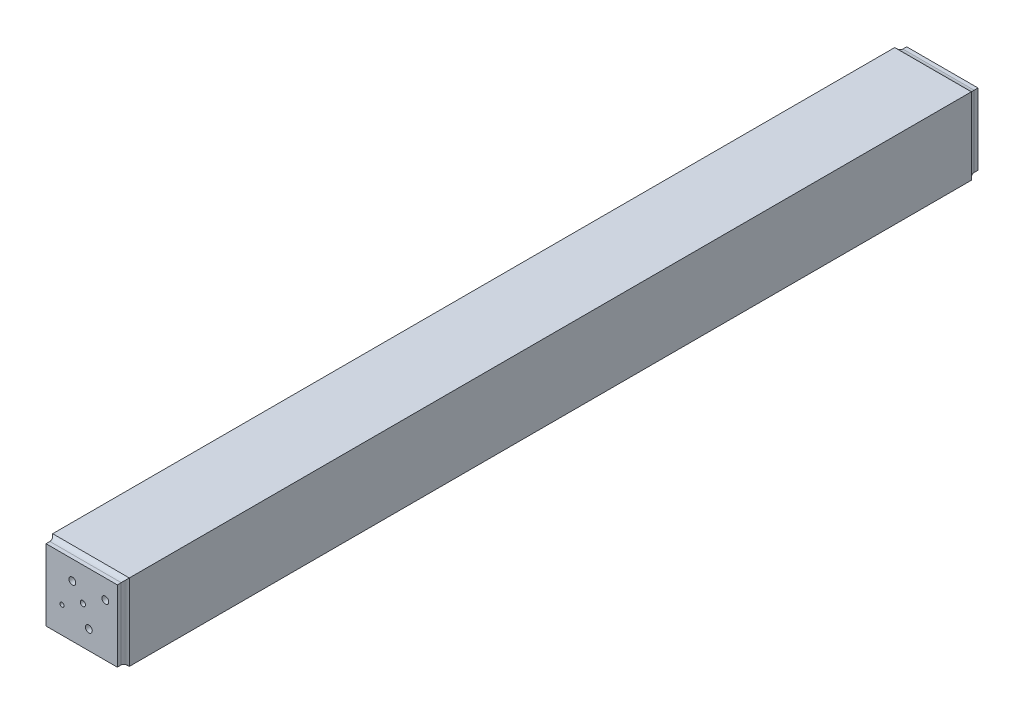
ISO-10303-21;
HEADER;
FILE_DESCRIPTION(('STEP AP214'),'2;1');
FILE_NAME('part.step','',(''),(''),'','','');
FILE_SCHEMA(('AUTOMOTIVE_DESIGN { 1 0 10303 214 1 1 1 1 }'));
ENDSEC;
DATA;
#1=APPLICATION_CONTEXT('core data for automotive mechanical design processes');
#2=APPLICATION_PROTOCOL_DEFINITION('international standard','automotive_design',2000,#1);
#3=PRODUCT_CONTEXT('',#1,'mechanical');
#4=PRODUCT('Part','Part','',(#3));
#5=PRODUCT_RELATED_PRODUCT_CATEGORY('part','',(#4));
#6=PRODUCT_DEFINITION_FORMATION('','',#4);
#7=PRODUCT_DEFINITION_CONTEXT('part definition',#1,'design');
#8=PRODUCT_DEFINITION('design','',#6,#7);
#9=PRODUCT_DEFINITION_SHAPE('','',#8);
#10=(LENGTH_UNIT() NAMED_UNIT(*) SI_UNIT(.MILLI.,.METRE.));
#11=(NAMED_UNIT(*) PLANE_ANGLE_UNIT() SI_UNIT($,.RADIAN.));
#12=(NAMED_UNIT(*) SI_UNIT($,.STERADIAN.) SOLID_ANGLE_UNIT());
#13=UNCERTAINTY_MEASURE_WITH_UNIT(LENGTH_MEASURE(1.E-05),#10,'distance_accuracy_value','');
#14=(GEOMETRIC_REPRESENTATION_CONTEXT(3) GLOBAL_UNCERTAINTY_ASSIGNED_CONTEXT((#13)) GLOBAL_UNIT_ASSIGNED_CONTEXT((#10,
#11,#12)) REPRESENTATION_CONTEXT('',''));
#15=CARTESIAN_POINT('',(0.,0.,0.));
#16=DIRECTION('',(0.,0.,1.));
#17=DIRECTION('',(1.,0.,0.));
#18=AXIS2_PLACEMENT_3D('',#15,#16,#17);
#19=CARTESIAN_POINT('',(42.98,-42.98,0.));
#20=DIRECTION('',(0.,0.,-1.));
#21=DIRECTION('',(-1.,0.,0.));
#22=AXIS2_PLACEMENT_3D('',#19,#20,#21);
#23=PLANE('',#22);
#24=CARTESIAN_POINT('',(12.93,-12.9,0.));
#25=DIRECTION('',(0.,0.,1.));
#26=DIRECTION('',(1.,0.,0.));
#27=AXIS2_PLACEMENT_3D('',#24,#25,#26);
#28=CIRCLE('',#27,2.);
#29=CARTESIAN_POINT('',(14.93,-12.9,0.));
#30=VERTEX_POINT('',#29);
#31=EDGE_CURVE('E249',#30,#30,#28,.T.);
#32=ORIENTED_EDGE('',*,*,#31,.F.);
#33=EDGE_LOOP('',(#32));
#34=FACE_BOUND('',#33,.T.);
#35=CARTESIAN_POINT('',(31.93,-12.9,0.));
#36=DIRECTION('',(0.,0.,1.));
#37=DIRECTION('',(1.,0.,0.));
#38=AXIS2_PLACEMENT_3D('',#35,#36,#37);
#39=CIRCLE('',#38,2.);
#40=CARTESIAN_POINT('',(33.93,-12.9,0.));
#41=VERTEX_POINT('',#40);
#42=EDGE_CURVE('E240',#41,#41,#39,.T.);
#43=ORIENTED_EDGE('',*,*,#42,.F.);
#44=EDGE_LOOP('',(#43));
#45=FACE_BOUND('',#44,.T.);
#46=DIRECTION('',(0.,1.,0.));
#47=VECTOR('',#46,1.);
#48=CARTESIAN_POINT('',(3.17499999999999,-3.175,0.));
#49=LINE('',#48,#47);
#50=CARTESIAN_POINT('',(3.17500000000001,-41.355,0.));
#51=VERTEX_POINT('',#50);
#52=CARTESIAN_POINT('',(3.175,-3.175,0.));
#53=VERTEX_POINT('',#52);
#54=EDGE_CURVE('E171',#51,#53,#49,.T.);
#55=ORIENTED_EDGE('',*,*,#54,.F.);
#56=DIRECTION('',(-1.,0.,0.));
#57=VECTOR('',#56,1.);
#58=CARTESIAN_POINT('',(3.17500000000001,-41.355,0.));
#59=LINE('',#58,#57);
#60=CARTESIAN_POINT('',(41.355,-41.355,0.));
#61=VERTEX_POINT('',#60);
#62=EDGE_CURVE('E184',#61,#51,#59,.T.);
#63=ORIENTED_EDGE('',*,*,#62,.F.);
#64=DIRECTION('',(0.,-1.,0.));
#65=VECTOR('',#64,1.);
#66=CARTESIAN_POINT('',(41.355,-3.17500000000001,0.));
#67=LINE('',#66,#65);
#68=CARTESIAN_POINT('',(41.355,-3.17500000000001,0.));
#69=VERTEX_POINT('',#68);
#70=EDGE_CURVE('E196',#69,#61,#67,.T.);
#71=ORIENTED_EDGE('',*,*,#70,.F.);
#72=DIRECTION('',(1.,0.,0.));
#73=VECTOR('',#72,1.);
#74=CARTESIAN_POINT('',(3.17499999999999,-3.175,0.));
#75=LINE('',#74,#73);
#76=EDGE_CURVE('E174',#53,#69,#75,.T.);
#77=ORIENTED_EDGE('',*,*,#76,.F.);
#78=EDGE_LOOP('',(#55,#63,#71,#77));
#79=FACE_BOUND('',#78,.T.);
#80=ADVANCED_FACE('F31',(#34,#45,#79),#23,.F.);
#81=CARTESIAN_POINT('',(42.98,-1.55,-5.42));
#82=DIRECTION('',(1.,0.,0.));
#83=DIRECTION('',(0.,1.,0.));
#84=AXIS2_PLACEMENT_3D('',#81,#82,#83);
#85=PLANE('',#84);
#86=DIRECTION('',(0.,0.,1.));
#87=VECTOR('',#86,1.);
#88=CARTESIAN_POINT('',(42.98,-1.55,-5.42));
#89=LINE('',#88,#87);
#90=CARTESIAN_POINT('',(42.98,-1.55,-5.42));
#91=VERTEX_POINT('',#90);
#92=CARTESIAN_POINT('',(42.98,-1.55,-3.16188235075248));
#93=VERTEX_POINT('',#92);
#94=EDGE_CURVE('E269',#91,#93,#89,.T.);
#95=ORIENTED_EDGE('',*,*,#94,.T.);
#96=DIRECTION('',(0.,-1.,0.));
#97=VECTOR('',#96,1.);
#98=CARTESIAN_POINT('',(42.98,-42.98,-3.16188235075249));
#99=LINE('',#98,#97);
#100=CARTESIAN_POINT('',(42.98,-42.98,-3.16188235075249));
#101=VERTEX_POINT('',#100);
#102=EDGE_CURVE('E40',#93,#101,#99,.T.);
#103=ORIENTED_EDGE('',*,*,#102,.T.);
#104=DIRECTION('',(0.,0.,1.));
#105=VECTOR('',#104,1.);
#106=CARTESIAN_POINT('',(42.98,-42.98,-5.42));
#107=LINE('',#106,#105);
#108=CARTESIAN_POINT('',(42.98,-42.98,-5.42));
#109=VERTEX_POINT('',#108);
#110=EDGE_CURVE('E270',#109,#101,#107,.T.);
#111=ORIENTED_EDGE('',*,*,#110,.F.);
#112=DIRECTION('',(0.,1.,0.));
#113=VECTOR('',#112,1.);
#114=CARTESIAN_POINT('',(42.98,-1.55,-5.42));
#115=LINE('',#114,#113);
#116=EDGE_CURVE('E255',#109,#91,#115,.T.);
#117=ORIENTED_EDGE('',*,*,#116,.T.);
#118=EDGE_LOOP('',(#95,#103,#111,#117));
#119=FACE_BOUND('',#118,.T.);
#120=ADVANCED_FACE('F378',(#119),#85,.T.);
#121=CARTESIAN_POINT('',(42.98,-42.98,-5.42));
#122=DIRECTION('',(0.,-1.,0.));
#123=DIRECTION('',(0.,0.,-1.));
#124=AXIS2_PLACEMENT_3D('',#121,#122,#123);
#125=PLANE('',#124);
#126=ORIENTED_EDGE('',*,*,#110,.T.);
#127=DIRECTION('',(-1.,0.,0.));
#128=VECTOR('',#127,1.);
#129=CARTESIAN_POINT('',(1.55,-42.98,-3.16188235075248));
#130=LINE('',#129,#128);
#131=CARTESIAN_POINT('',(1.55,-42.98,-3.16188235075248));
#132=VERTEX_POINT('',#131);
#133=EDGE_CURVE('E288',#101,#132,#130,.T.);
#134=ORIENTED_EDGE('',*,*,#133,.T.);
#135=DIRECTION('',(0.,0.,1.));
#136=VECTOR('',#135,1.);
#137=CARTESIAN_POINT('',(1.55,-42.98,-5.42));
#138=LINE('',#137,#136);
#139=CARTESIAN_POINT('',(1.55,-42.98,-5.42));
#140=VERTEX_POINT('',#139);
#141=EDGE_CURVE('E273',#140,#132,#138,.T.);
#142=ORIENTED_EDGE('',*,*,#141,.F.);
#143=DIRECTION('',(1.,0.,0.));
#144=VECTOR('',#143,1.);
#145=CARTESIAN_POINT('',(42.98,-42.98,-5.42));
#146=LINE('',#145,#144);
#147=EDGE_CURVE('E266',#140,#109,#146,.T.);
#148=ORIENTED_EDGE('',*,*,#147,.T.);
#149=EDGE_LOOP('',(#126,#134,#142,#148));
#150=FACE_BOUND('',#149,.T.);
#151=ADVANCED_FACE('F321',(#150),#125,.T.);
#152=CARTESIAN_POINT('',(1.55,-1.55,-5.42));
#153=DIRECTION('',(-1.,0.,0.));
#154=DIRECTION('',(0.,-1.,0.));
#155=AXIS2_PLACEMENT_3D('',#152,#153,#154);
#156=PLANE('',#155);
#157=ORIENTED_EDGE('',*,*,#141,.T.);
#158=DIRECTION('',(0.,1.,0.));
#159=VECTOR('',#158,1.);
#160=CARTESIAN_POINT('',(1.55,-1.55,-3.16188235075248));
#161=LINE('',#160,#159);
#162=CARTESIAN_POINT('',(1.55,-1.55,-3.16188235075248));
#163=VERTEX_POINT('',#162);
#164=EDGE_CURVE('E285',#132,#163,#161,.T.);
#165=ORIENTED_EDGE('',*,*,#164,.T.);
#166=DIRECTION('',(0.,0.,1.));
#167=VECTOR('',#166,1.);
#168=CARTESIAN_POINT('',(1.55,-1.55,-5.42));
#169=LINE('',#168,#167);
#170=CARTESIAN_POINT('',(1.55,-1.55,-5.42));
#171=VERTEX_POINT('',#170);
#172=EDGE_CURVE('E276',#171,#163,#169,.T.);
#173=ORIENTED_EDGE('',*,*,#172,.F.);
#174=DIRECTION('',(0.,-1.,0.));
#175=VECTOR('',#174,1.);
#176=CARTESIAN_POINT('',(1.55,-1.55,-5.42));
#177=LINE('',#176,#175);
#178=EDGE_CURVE('E263',#171,#140,#177,.T.);
#179=ORIENTED_EDGE('',*,*,#178,.T.);
#180=EDGE_LOOP('',(#157,#165,#173,#179));
#181=FACE_BOUND('',#180,.T.);
#182=ADVANCED_FACE('F324',(#181),#156,.T.);
#183=CARTESIAN_POINT('',(42.98,-1.55,-5.42));
#184=DIRECTION('',(0.,1.,0.));
#185=DIRECTION('',(0.,0.,1.));
#186=AXIS2_PLACEMENT_3D('',#183,#184,#185);
#187=PLANE('',#186);
#188=ORIENTED_EDGE('',*,*,#172,.T.);
#189=DIRECTION('',(1.,0.,0.));
#190=VECTOR('',#189,1.);
#191=CARTESIAN_POINT('',(42.98,-1.55,-3.16188235075248));
#192=LINE('',#191,#190);
#193=EDGE_CURVE('E11',#163,#93,#192,.T.);
#194=ORIENTED_EDGE('',*,*,#193,.T.);
#195=ORIENTED_EDGE('',*,*,#94,.F.);
#196=DIRECTION('',(-1.,0.,0.));
#197=VECTOR('',#196,1.);
#198=CARTESIAN_POINT('',(42.98,-1.55,-5.42));
#199=LINE('',#198,#197);
#200=EDGE_CURVE('E260',#91,#171,#199,.T.);
#201=ORIENTED_EDGE('',*,*,#200,.T.);
#202=EDGE_LOOP('',(#188,#194,#195,#201));
#203=FACE_BOUND('',#202,.T.);
#204=ADVANCED_FACE('F395',(#203),#187,.T.);
#205=CARTESIAN_POINT('',(42.98,-42.98,-5.42));
#206=DIRECTION('',(0.,0.,-1.));
#207=DIRECTION('',(-1.,0.,0.));
#208=AXIS2_PLACEMENT_3D('',#205,#206,#207);
#209=PLANE('',#208);
#210=CARTESIAN_POINT('',(31.93,-12.9,-5.42));
#211=DIRECTION('',(0.,0.,1.));
#212=DIRECTION('',(1.,0.,0.));
#213=AXIS2_PLACEMENT_3D('',#210,#211,#212);
#214=CIRCLE('',#213,2.);
#215=CARTESIAN_POINT('',(33.93,-12.9,-5.42));
#216=VERTEX_POINT('',#215);
#217=EDGE_CURVE('E246',#216,#216,#214,.T.);
#218=ORIENTED_EDGE('',*,*,#217,.T.);
#219=EDGE_LOOP('',(#218));
#220=FACE_BOUND('',#219,.T.);
#221=CARTESIAN_POINT('',(12.93,-12.9,-5.42));
#222=DIRECTION('',(0.,0.,1.));
#223=DIRECTION('',(1.,0.,0.));
#224=AXIS2_PLACEMENT_3D('',#221,#222,#223);
#225=CIRCLE('',#224,2.);
#226=CARTESIAN_POINT('',(14.93,-12.9,-5.42));
#227=VERTEX_POINT('',#226);
#228=EDGE_CURVE('E252',#227,#227,#225,.T.);
#229=ORIENTED_EDGE('',*,*,#228,.T.);
#230=EDGE_LOOP('',(#229));
#231=FACE_BOUND('',#230,.T.);
#232=ORIENTED_EDGE('',*,*,#116,.F.);
#233=ORIENTED_EDGE('',*,*,#147,.F.);
#234=ORIENTED_EDGE('',*,*,#178,.F.);
#235=ORIENTED_EDGE('',*,*,#200,.F.);
#236=EDGE_LOOP('',(#232,#233,#234,#235));
#237=FACE_BOUND('',#236,.T.);
#238=ADVANCED_FACE('F389',(#220,#231,#237),#209,.T.);
#239=CARTESIAN_POINT('',(12.93,-12.9,-5.42));
#240=DIRECTION('',(0.,0.,1.));
#241=DIRECTION('',(1.,0.,0.));
#242=AXIS2_PLACEMENT_3D('',#239,#240,#241);
#243=CYLINDRICAL_SURFACE('',#242,2.);
#244=ORIENTED_EDGE('',*,*,#228,.F.);
#245=EDGE_LOOP('',(#244));
#246=FACE_BOUND('',#245,.T.);
#247=ORIENTED_EDGE('',*,*,#31,.T.);
#248=EDGE_LOOP('',(#247));
#249=FACE_BOUND('',#248,.T.);
#250=ADVANCED_FACE('F657',(#246,#249),#243,.F.);
#251=CARTESIAN_POINT('',(31.93,-12.9,-5.42));
#252=DIRECTION('',(0.,0.,1.));
#253=DIRECTION('',(1.,0.,0.));
#254=AXIS2_PLACEMENT_3D('',#251,#252,#253);
#255=CYLINDRICAL_SURFACE('',#254,2.);
#256=ORIENTED_EDGE('',*,*,#217,.F.);
#257=EDGE_LOOP('',(#256));
#258=FACE_BOUND('',#257,.T.);
#259=ORIENTED_EDGE('',*,*,#42,.T.);
#260=EDGE_LOOP('',(#259));
#261=FACE_BOUND('',#260,.T.);
#262=ADVANCED_FACE('F520',(#258,#261),#255,.F.);
#263=CARTESIAN_POINT('',(0.,0.,489.16));
#264=DIRECTION('',(-1.,0.,0.));
#265=DIRECTION('',(0.,-1.,0.));
#266=AXIS2_PLACEMENT_3D('',#263,#264,#265);
#267=PLANE('',#266);
#268=DIRECTION('',(0.,1.,0.));
#269=VECTOR('',#268,1.);
#270=CARTESIAN_POINT('',(0.,0.,0.));
#271=LINE('',#270,#269);
#272=CARTESIAN_POINT('',(0.,-44.53,0.));
#273=VERTEX_POINT('',#272);
#274=CARTESIAN_POINT('',(0.,0.,0.));
#275=VERTEX_POINT('',#274);
#276=EDGE_CURVE('E204',#273,#275,#271,.T.);
#277=ORIENTED_EDGE('',*,*,#276,.F.);
#278=DIRECTION('',(0.,0.,-1.));
#279=VECTOR('',#278,1.);
#280=CARTESIAN_POINT('',(0.,-44.53,489.16));
#281=LINE('',#280,#279);
#282=CARTESIAN_POINT('',(0.,-44.53,489.16));
#283=VERTEX_POINT('',#282);
#284=EDGE_CURVE('E237',#283,#273,#281,.T.);
#285=ORIENTED_EDGE('',*,*,#284,.F.);
#286=DIRECTION('',(0.,1.,0.));
#287=VECTOR('',#286,1.);
#288=CARTESIAN_POINT('',(0.,0.,489.16));
#289=LINE('',#288,#287);
#290=CARTESIAN_POINT('',(0.,0.,489.16));
#291=VERTEX_POINT('',#290);
#292=EDGE_CURVE('E213',#283,#291,#289,.T.);
#293=ORIENTED_EDGE('',*,*,#292,.T.);
#294=DIRECTION('',(0.,0.,-1.));
#295=VECTOR('',#294,1.);
#296=CARTESIAN_POINT('',(0.,0.,489.16));
#297=LINE('',#296,#295);
#298=EDGE_CURVE('E226',#291,#275,#297,.T.);
#299=ORIENTED_EDGE('',*,*,#298,.T.);
#300=EDGE_LOOP('',(#277,#285,#293,#299));
#301=FACE_BOUND('',#300,.T.);
#302=ADVANCED_FACE('F332',(#301),#267,.T.);
#303=CARTESIAN_POINT('',(0.,-44.53,489.16));
#304=DIRECTION('',(0.,-1.,0.));
#305=DIRECTION('',(0.,0.,-1.));
#306=AXIS2_PLACEMENT_3D('',#303,#304,#305);
#307=PLANE('',#306);
#308=DIRECTION('',(-1.,0.,0.));
#309=VECTOR('',#308,1.);
#310=CARTESIAN_POINT('',(0.,-44.53,0.));
#311=LINE('',#310,#309);
#312=CARTESIAN_POINT('',(44.53,-44.53,0.));
#313=VERTEX_POINT('',#312);
#314=EDGE_CURVE('E217',#313,#273,#311,.T.);
#315=ORIENTED_EDGE('',*,*,#314,.F.);
#316=DIRECTION('',(0.,0.,-1.));
#317=VECTOR('',#316,1.);
#318=CARTESIAN_POINT('',(44.53,-44.53,489.16));
#319=LINE('',#318,#317);
#320=CARTESIAN_POINT('',(44.53,-44.53,489.16));
#321=VERTEX_POINT('',#320);
#322=EDGE_CURVE('E241',#321,#313,#319,.T.);
#323=ORIENTED_EDGE('',*,*,#322,.F.);
#324=DIRECTION('',(-1.,0.,0.));
#325=VECTOR('',#324,1.);
#326=CARTESIAN_POINT('',(0.,-44.53,489.16));
#327=LINE('',#326,#325);
#328=EDGE_CURVE('E223',#321,#283,#327,.T.);
#329=ORIENTED_EDGE('',*,*,#328,.T.);
#330=ORIENTED_EDGE('',*,*,#284,.T.);
#331=EDGE_LOOP('',(#315,#323,#329,#330));
#332=FACE_BOUND('',#331,.T.);
#333=ADVANCED_FACE('F344',(#332),#307,.T.);
#334=CARTESIAN_POINT('',(44.53,0.,489.16));
#335=DIRECTION('',(1.,0.,0.));
#336=DIRECTION('',(0.,1.,0.));
#337=AXIS2_PLACEMENT_3D('',#334,#335,#336);
#338=PLANE('',#337);
#339=DIRECTION('',(0.,-1.,0.));
#340=VECTOR('',#339,1.);
#341=CARTESIAN_POINT('',(44.53,0.,0.));
#342=LINE('',#341,#340);
#343=CARTESIAN_POINT('',(44.53,0.,0.));
#344=VERTEX_POINT('',#343);
#345=EDGE_CURVE('E232',#344,#313,#342,.T.);
#346=ORIENTED_EDGE('',*,*,#345,.F.);
#347=DIRECTION('',(0.,0.,-1.));
#348=VECTOR('',#347,1.);
#349=CARTESIAN_POINT('',(44.53,0.,489.16));
#350=LINE('',#349,#348);
#351=CARTESIAN_POINT('',(44.53,0.,489.16));
#352=VERTEX_POINT('',#351);
#353=EDGE_CURVE('E243',#352,#344,#350,.T.);
#354=ORIENTED_EDGE('',*,*,#353,.F.);
#355=DIRECTION('',(0.,-1.,0.));
#356=VECTOR('',#355,1.);
#357=CARTESIAN_POINT('',(44.53,0.,489.16));
#358=LINE('',#357,#356);
#359=EDGE_CURVE('E220',#352,#321,#358,.T.);
#360=ORIENTED_EDGE('',*,*,#359,.T.);
#361=ORIENTED_EDGE('',*,*,#322,.T.);
#362=EDGE_LOOP('',(#346,#354,#360,#361));
#363=FACE_BOUND('',#362,.T.);
#364=ADVANCED_FACE('F339',(#363),#338,.T.);
#365=CARTESIAN_POINT('',(0.,0.,489.16));
#366=DIRECTION('',(0.,1.,0.));
#367=DIRECTION('',(0.,0.,1.));
#368=AXIS2_PLACEMENT_3D('',#365,#366,#367);
#369=PLANE('',#368);
#370=DIRECTION('',(1.,0.,0.));
#371=VECTOR('',#370,1.);
#372=CARTESIAN_POINT('',(0.,0.,0.));
#373=LINE('',#372,#371);
#374=EDGE_CURVE('E229',#275,#344,#373,.T.);
#375=ORIENTED_EDGE('',*,*,#374,.F.);
#376=ORIENTED_EDGE('',*,*,#298,.F.);
#377=DIRECTION('',(1.,0.,0.));
#378=VECTOR('',#377,1.);
#379=CARTESIAN_POINT('',(0.,0.,489.16));
#380=LINE('',#379,#378);
#381=EDGE_CURVE('E216',#291,#352,#380,.T.);
#382=ORIENTED_EDGE('',*,*,#381,.T.);
#383=ORIENTED_EDGE('',*,*,#353,.T.);
#384=EDGE_LOOP('',(#375,#376,#382,#383));
#385=FACE_BOUND('',#384,.T.);
#386=ADVANCED_FACE('F336',(#385),#369,.T.);
#387=CARTESIAN_POINT('',(3.17499999999999,-3.175,489.16));
#388=DIRECTION('',(-1.,0.,0.));
#389=DIRECTION('',(0.,-1.,0.));
#390=AXIS2_PLACEMENT_3D('',#387,#388,#389);
#391=PLANE('',#390);
#392=ORIENTED_EDGE('',*,*,#54,.T.);
#393=DIRECTION('',(0.,0.,-1.));
#394=VECTOR('',#393,1.);
#395=CARTESIAN_POINT('',(3.17499999999999,-3.175,489.16));
#396=LINE('',#395,#394);
#397=CARTESIAN_POINT('',(3.17499999999999,-3.175,489.16));
#398=VERTEX_POINT('',#397);
#399=EDGE_CURVE('E192',#398,#53,#396,.T.);
#400=ORIENTED_EDGE('',*,*,#399,.F.);
#401=DIRECTION('',(0.,1.,0.));
#402=VECTOR('',#401,1.);
#403=CARTESIAN_POINT('',(3.17499999999999,-3.175,489.16));
#404=LINE('',#403,#402);
#405=CARTESIAN_POINT('',(3.17500000000001,-41.355,489.16));
#406=VERTEX_POINT('',#405);
#407=EDGE_CURVE('E180',#406,#398,#404,.T.);
#408=ORIENTED_EDGE('',*,*,#407,.F.);
#409=DIRECTION('',(0.,0.,-1.));
#410=VECTOR('',#409,1.);
#411=CARTESIAN_POINT('',(3.17500000000001,-41.355,489.16));
#412=LINE('',#411,#410);
#413=EDGE_CURVE('E201',#406,#51,#412,.T.);
#414=ORIENTED_EDGE('',*,*,#413,.T.);
#415=EDGE_LOOP('',(#392,#400,#408,#414));
#416=FACE_BOUND('',#415,.T.);
#417=ADVANCED_FACE('F493',(#416),#391,.F.);
#418=CARTESIAN_POINT('',(3.17500000000001,-41.355,489.16));
#419=DIRECTION('',(0.,-1.,0.));
#420=DIRECTION('',(1.,0.,0.));
#421=AXIS2_PLACEMENT_3D('',#418,#419,#420);
#422=PLANE('',#421);
#423=ORIENTED_EDGE('',*,*,#62,.T.);
#424=ORIENTED_EDGE('',*,*,#413,.F.);
#425=DIRECTION('',(-1.,0.,0.));
#426=VECTOR('',#425,1.);
#427=CARTESIAN_POINT('',(3.17500000000001,-41.355,489.16));
#428=LINE('',#427,#426);
#429=CARTESIAN_POINT('',(41.355,-41.355,489.16));
#430=VERTEX_POINT('',#429);
#431=EDGE_CURVE('E190',#430,#406,#428,.T.);
#432=ORIENTED_EDGE('',*,*,#431,.F.);
#433=DIRECTION('',(0.,0.,-1.));
#434=VECTOR('',#433,1.);
#435=CARTESIAN_POINT('',(41.355,-41.355,489.16));
#436=LINE('',#435,#434);
#437=EDGE_CURVE('E205',#430,#61,#436,.T.);
#438=ORIENTED_EDGE('',*,*,#437,.T.);
#439=EDGE_LOOP('',(#423,#424,#432,#438));
#440=FACE_BOUND('',#439,.T.);
#441=ADVANCED_FACE('F629',(#440),#422,.F.);
#442=CARTESIAN_POINT('',(41.355,-3.17500000000001,489.16));
#443=DIRECTION('',(1.,0.,0.));
#444=DIRECTION('',(0.,1.,0.));
#445=AXIS2_PLACEMENT_3D('',#442,#443,#444);
#446=PLANE('',#445);
#447=ORIENTED_EDGE('',*,*,#70,.T.);
#448=ORIENTED_EDGE('',*,*,#437,.F.);
#449=DIRECTION('',(0.,-1.,0.));
#450=VECTOR('',#449,1.);
#451=CARTESIAN_POINT('',(41.355,-3.17500000000001,489.16));
#452=LINE('',#451,#450);
#453=CARTESIAN_POINT('',(41.355,-3.17500000000001,489.16));
#454=VERTEX_POINT('',#453);
#455=EDGE_CURVE('E187',#454,#430,#452,.T.);
#456=ORIENTED_EDGE('',*,*,#455,.F.);
#457=DIRECTION('',(0.,0.,-1.));
#458=VECTOR('',#457,1.);
#459=CARTESIAN_POINT('',(41.355,-3.17500000000001,489.16));
#460=LINE('',#459,#458);
#461=EDGE_CURVE('E208',#454,#69,#460,.T.);
#462=ORIENTED_EDGE('',*,*,#461,.T.);
#463=EDGE_LOOP('',(#447,#448,#456,#462));
#464=FACE_BOUND('',#463,.T.);
#465=ADVANCED_FACE('F619',(#464),#446,.F.);
#466=CARTESIAN_POINT('',(3.17499999999999,-3.175,489.16));
#467=DIRECTION('',(0.,1.,0.));
#468=DIRECTION('',(-1.,0.,0.));
#469=AXIS2_PLACEMENT_3D('',#466,#467,#468);
#470=PLANE('',#469);
#471=ORIENTED_EDGE('',*,*,#76,.T.);
#472=ORIENTED_EDGE('',*,*,#461,.F.);
#473=DIRECTION('',(1.,0.,0.));
#474=VECTOR('',#473,1.);
#475=CARTESIAN_POINT('',(3.17499999999999,-3.175,489.16));
#476=LINE('',#475,#474);
#477=EDGE_CURVE('E183',#398,#454,#476,.T.);
#478=ORIENTED_EDGE('',*,*,#477,.F.);
#479=ORIENTED_EDGE('',*,*,#399,.T.);
#480=EDGE_LOOP('',(#471,#472,#478,#479));
#481=FACE_BOUND('',#480,.T.);
#482=ADVANCED_FACE('F609',(#481),#470,.F.);
#483=CARTESIAN_POINT('',(1.55000000000001,-42.98,489.16));
#484=DIRECTION('',(0.,0.,1.));
#485=DIRECTION('',(1.,0.,0.));
#486=AXIS2_PLACEMENT_3D('',#483,#484,#485);
#487=PLANE('',#486);
#488=CARTESIAN_POINT('',(10.8715012997465,-27.5658338814324,489.16));
#489=DIRECTION('',(0.,0.,1.));
#490=DIRECTION('',(1.,0.,0.));
#491=AXIS2_PLACEMENT_3D('',#488,#489,#490);
#492=CIRCLE('',#491,1.2);
#493=CARTESIAN_POINT('',(12.0715012997465,-27.5658338814324,489.16));
#494=VERTEX_POINT('',#493);
#495=EDGE_CURVE('E301',#494,#494,#492,.T.);
#496=ORIENTED_EDGE('',*,*,#495,.T.);
#497=EDGE_LOOP('',(#496));
#498=FACE_BOUND('',#497,.T.);
#499=CARTESIAN_POINT('',(26.4250000000001,-32.01,489.16));
#500=DIRECTION('',(0.,0.,1.));
#501=DIRECTION('',(1.,0.,0.));
#502=AXIS2_PLACEMENT_3D('',#499,#500,#501);
#503=CIRCLE('',#502,2.);
#504=CARTESIAN_POINT('',(28.4250000000001,-32.01,489.16));
#505=VERTEX_POINT('',#504);
#506=EDGE_CURVE('E697',#505,#505,#503,.T.);
#507=ORIENTED_EDGE('',*,*,#506,.T.);
#508=EDGE_LOOP('',(#507));
#509=FACE_BOUND('',#508,.T.);
#510=CARTESIAN_POINT('',(16.8400000000001,-12.6754667757403,489.16));
#511=DIRECTION('',(0.,0.,1.));
#512=DIRECTION('',(1.,0.,0.));
#513=AXIS2_PLACEMENT_3D('',#510,#511,#512);
#514=CIRCLE('',#513,2.);
#515=CARTESIAN_POINT('',(18.8400000000001,-12.6754667757403,489.16));
#516=VERTEX_POINT('',#515);
#517=EDGE_CURVE('E701',#516,#516,#514,.T.);
#518=ORIENTED_EDGE('',*,*,#517,.T.);
#519=EDGE_LOOP('',(#518));
#520=FACE_BOUND('',#519,.T.);
#521=CARTESIAN_POINT('',(36.0100000000001,-12.6754667757403,489.16));
#522=DIRECTION('',(0.,0.,1.));
#523=DIRECTION('',(1.,0.,0.));
#524=AXIS2_PLACEMENT_3D('',#521,#522,#523);
#525=CIRCLE('',#524,2.);
#526=CARTESIAN_POINT('',(38.0100000000001,-12.6754667757403,489.16));
#527=VERTEX_POINT('',#526);
#528=EDGE_CURVE('E705',#527,#527,#525,.T.);
#529=ORIENTED_EDGE('',*,*,#528,.T.);
#530=EDGE_LOOP('',(#529));
#531=FACE_BOUND('',#530,.T.);
#532=CARTESIAN_POINT('',(22.9727513704461,-20.9269550118449,489.16));
#533=DIRECTION('',(0.,0.,1.));
#534=DIRECTION('',(1.,0.,0.));
#535=AXIS2_PLACEMENT_3D('',#532,#533,#534);
#536=CIRCLE('',#535,1.505);
#537=CARTESIAN_POINT('',(24.4777513704461,-20.9269550118449,489.16));
#538=VERTEX_POINT('',#537);
#539=EDGE_CURVE('E708',#538,#538,#536,.T.);
#540=ORIENTED_EDGE('',*,*,#539,.T.);
#541=EDGE_LOOP('',(#540));
#542=FACE_BOUND('',#541,.T.);
#543=ORIENTED_EDGE('',*,*,#431,.T.);
#544=ORIENTED_EDGE('',*,*,#407,.T.);
#545=ORIENTED_EDGE('',*,*,#477,.T.);
#546=ORIENTED_EDGE('',*,*,#455,.T.);
#547=EDGE_LOOP('',(#543,#544,#545,#546));
#548=FACE_BOUND('',#547,.T.);
#549=ADVANCED_FACE('F599',(#498,#509,#520,#531,#542,#548),#487,.F.);
#550=CARTESIAN_POINT('',(1.55000000000001,-42.98,494.58));
#551=DIRECTION('',(0.,0.,1.));
#552=DIRECTION('',(1.,0.,0.));
#553=AXIS2_PLACEMENT_3D('',#550,#551,#552);
#554=PLANE('',#553);
#555=CARTESIAN_POINT('',(22.9727513704461,-20.9269550118449,494.58));
#556=DIRECTION('',(0.,0.,1.));
#557=DIRECTION('',(1.,0.,0.));
#558=AXIS2_PLACEMENT_3D('',#555,#556,#557);
#559=CIRCLE('',#558,1.505);
#560=CARTESIAN_POINT('',(24.4777513704461,-20.9269550118449,494.58));
#561=VERTEX_POINT('',#560);
#562=EDGE_CURVE('E710',#561,#561,#559,.T.);
#563=ORIENTED_EDGE('',*,*,#562,.F.);
#564=EDGE_LOOP('',(#563));
#565=FACE_BOUND('',#564,.T.);
#566=CARTESIAN_POINT('',(36.0100000000001,-12.6754667757403,494.58));
#567=DIRECTION('',(0.,0.,1.));
#568=DIRECTION('',(1.,0.,0.));
#569=AXIS2_PLACEMENT_3D('',#566,#567,#568);
#570=CIRCLE('',#569,2.);
#571=CARTESIAN_POINT('',(38.0100000000001,-12.6754667757403,494.58));
#572=VERTEX_POINT('',#571);
#573=EDGE_CURVE('E723',#572,#572,#570,.T.);
#574=ORIENTED_EDGE('',*,*,#573,.F.);
#575=EDGE_LOOP('',(#574));
#576=FACE_BOUND('',#575,.T.);
#577=DIRECTION('',(0.,-1.,0.));
#578=VECTOR('',#577,1.);
#579=CARTESIAN_POINT('',(1.55000000000001,-1.55,494.58));
#580=LINE('',#579,#578);
#581=CARTESIAN_POINT('',(1.55000000000001,-1.55,494.58));
#582=VERTEX_POINT('',#581);
#583=CARTESIAN_POINT('',(1.55000000000001,-42.98,494.58));
#584=VERTEX_POINT('',#583);
#585=EDGE_CURVE('E156',#582,#584,#580,.T.);
#586=ORIENTED_EDGE('',*,*,#585,.T.);
#587=DIRECTION('',(1.,0.,0.));
#588=VECTOR('',#587,1.);
#589=CARTESIAN_POINT('',(1.55000000000001,-42.98,494.58));
#590=LINE('',#589,#588);
#591=CARTESIAN_POINT('',(42.98,-42.98,494.58));
#592=VERTEX_POINT('',#591);
#593=EDGE_CURVE('E144',#584,#592,#590,.T.);
#594=ORIENTED_EDGE('',*,*,#593,.T.);
#595=DIRECTION('',(0.,1.,0.));
#596=VECTOR('',#595,1.);
#597=CARTESIAN_POINT('',(42.98,-1.55,494.58));
#598=LINE('',#597,#596);
#599=CARTESIAN_POINT('',(42.98,-1.55,494.58));
#600=VERTEX_POINT('',#599);
#601=EDGE_CURVE('E155',#592,#600,#598,.T.);
#602=ORIENTED_EDGE('',*,*,#601,.T.);
#603=DIRECTION('',(-1.,0.,0.));
#604=VECTOR('',#603,1.);
#605=CARTESIAN_POINT('',(1.55000000000001,-1.55,494.58));
#606=LINE('',#605,#604);
#607=EDGE_CURVE('E162',#600,#582,#606,.T.);
#608=ORIENTED_EDGE('',*,*,#607,.T.);
#609=EDGE_LOOP('',(#586,#594,#602,#608));
#610=FACE_BOUND('',#609,.T.);
#611=CARTESIAN_POINT('',(16.8400000000001,-12.6754667757403,494.58));
#612=DIRECTION('',(0.,0.,1.));
#613=DIRECTION('',(1.,0.,0.));
#614=AXIS2_PLACEMENT_3D('',#611,#612,#613);
#615=CIRCLE('',#614,2.);
#616=CARTESIAN_POINT('',(18.8400000000001,-12.6754667757403,494.58));
#617=VERTEX_POINT('',#616);
#618=EDGE_CURVE('E166',#617,#617,#615,.T.);
#619=ORIENTED_EDGE('',*,*,#618,.F.);
#620=EDGE_LOOP('',(#619));
#621=FACE_BOUND('',#620,.T.);
#622=CARTESIAN_POINT('',(26.4250000000001,-32.01,494.58));
#623=DIRECTION('',(0.,0.,1.));
#624=DIRECTION('',(1.,0.,0.));
#625=AXIS2_PLACEMENT_3D('',#622,#623,#624);
#626=CIRCLE('',#625,2.);
#627=CARTESIAN_POINT('',(28.4250000000001,-32.01,494.58));
#628=VERTEX_POINT('',#627);
#629=EDGE_CURVE('E719',#628,#628,#626,.T.);
#630=ORIENTED_EDGE('',*,*,#629,.F.);
#631=EDGE_LOOP('',(#630));
#632=FACE_BOUND('',#631,.T.);
#633=CARTESIAN_POINT('',(10.8715012997465,-27.5658338814324,494.58));
#634=DIRECTION('',(0.,0.,1.));
#635=DIRECTION('',(1.,0.,0.));
#636=AXIS2_PLACEMENT_3D('',#633,#634,#635);
#637=CIRCLE('',#636,1.2);
#638=CARTESIAN_POINT('',(12.0715012997465,-27.5658338814324,494.58));
#639=VERTEX_POINT('',#638);
#640=EDGE_CURVE('E711',#639,#639,#637,.T.);
#641=ORIENTED_EDGE('',*,*,#640,.F.);
#642=EDGE_LOOP('',(#641));
#643=FACE_BOUND('',#642,.T.);
#644=ADVANCED_FACE('F159',(#565,#576,#610,#621,#632,#643),#554,.T.);
#645=CARTESIAN_POINT('',(1.55000000000001,-1.55,494.58));
#646=DIRECTION('',(1.,0.,0.));
#647=DIRECTION('',(0.,0.,-1.));
#648=AXIS2_PLACEMENT_3D('',#645,#646,#647);
#649=PLANE('',#648);
#650=DIRECTION('',(0.,0.,-1.));
#651=VECTOR('',#650,1.);
#652=CARTESIAN_POINT('',(1.55000000000001,-1.55,494.58));
#653=LINE('',#652,#651);
#654=CARTESIAN_POINT('',(1.55000000000001,-1.55,492.321882350753));
#655=VERTEX_POINT('',#654);
#656=EDGE_CURVE('E357',#582,#655,#653,.T.);
#657=ORIENTED_EDGE('',*,*,#656,.T.);
#658=DIRECTION('',(0.,-1.,0.));
#659=VECTOR('',#658,1.);
#660=CARTESIAN_POINT('',(1.55000000000001,-1.55,492.321882350753));
#661=LINE('',#660,#659);
#662=CARTESIAN_POINT('',(1.55000000000001,-42.98,492.321882350753));
#663=VERTEX_POINT('',#662);
#664=EDGE_CURVE('E170',#655,#663,#661,.T.);
#665=ORIENTED_EDGE('',*,*,#664,.T.);
#666=DIRECTION('',(0.,0.,-1.));
#667=VECTOR('',#666,1.);
#668=CARTESIAN_POINT('',(1.55000000000001,-42.98,494.58));
#669=LINE('',#668,#667);
#670=EDGE_CURVE('E149',#584,#663,#669,.T.);
#671=ORIENTED_EDGE('',*,*,#670,.F.);
#672=ORIENTED_EDGE('',*,*,#585,.F.);
#673=EDGE_LOOP('',(#657,#665,#671,#672));
#674=FACE_BOUND('',#673,.T.);
#675=ADVANCED_FACE('F168',(#674),#649,.F.);
#676=CARTESIAN_POINT('',(1.55000000000001,-42.98,494.58));
#677=DIRECTION('',(0.,1.,0.));
#678=DIRECTION('',(-1.,0.,0.));
#679=AXIS2_PLACEMENT_3D('',#676,#677,#678);
#680=PLANE('',#679);
#681=ORIENTED_EDGE('',*,*,#670,.T.);
#682=DIRECTION('',(1.,0.,0.));
#683=VECTOR('',#682,1.);
#684=CARTESIAN_POINT('',(1.55000000000001,-42.98,492.321882350753));
#685=LINE('',#684,#683);
#686=CARTESIAN_POINT('',(42.98,-42.98,492.321882350753));
#687=VERTEX_POINT('',#686);
#688=EDGE_CURVE('E272',#663,#687,#685,.T.);
#689=ORIENTED_EDGE('',*,*,#688,.T.);
#690=DIRECTION('',(0.,0.,-1.));
#691=VECTOR('',#690,1.);
#692=CARTESIAN_POINT('',(42.98,-42.98,494.58));
#693=LINE('',#692,#691);
#694=EDGE_CURVE('E152',#592,#687,#693,.T.);
#695=ORIENTED_EDGE('',*,*,#694,.F.);
#696=ORIENTED_EDGE('',*,*,#593,.F.);
#697=EDGE_LOOP('',(#681,#689,#695,#696));
#698=FACE_BOUND('',#697,.T.);
#699=ADVANCED_FACE('F146',(#698),#680,.F.);
#700=CARTESIAN_POINT('',(42.98,-1.55,494.58));
#701=DIRECTION('',(-1.,0.,0.));
#702=DIRECTION('',(0.,-1.,0.));
#703=AXIS2_PLACEMENT_3D('',#700,#701,#702);
#704=PLANE('',#703);
#705=ORIENTED_EDGE('',*,*,#694,.T.);
#706=DIRECTION('',(0.,1.,0.));
#707=VECTOR('',#706,1.);
#708=CARTESIAN_POINT('',(42.98,-1.55,492.321882350753));
#709=LINE('',#708,#707);
#710=CARTESIAN_POINT('',(42.98,-1.55,492.321882350753));
#711=VERTEX_POINT('',#710);
#712=EDGE_CURVE('E280',#687,#711,#709,.T.);
#713=ORIENTED_EDGE('',*,*,#712,.T.);
#714=DIRECTION('',(0.,0.,-1.));
#715=VECTOR('',#714,1.);
#716=CARTESIAN_POINT('',(42.98,-1.55,494.58));
#717=LINE('',#716,#715);
#718=EDGE_CURVE('E176',#600,#711,#717,.T.);
#719=ORIENTED_EDGE('',*,*,#718,.F.);
#720=ORIENTED_EDGE('',*,*,#601,.F.);
#721=EDGE_LOOP('',(#705,#713,#719,#720));
#722=FACE_BOUND('',#721,.T.);
#723=ADVANCED_FACE('F355',(#722),#704,.F.);
#724=CARTESIAN_POINT('',(1.55000000000001,-1.55,494.58));
#725=DIRECTION('',(0.,-1.,0.));
#726=DIRECTION('',(1.,0.,0.));
#727=AXIS2_PLACEMENT_3D('',#724,#725,#726);
#728=PLANE('',#727);
#729=ORIENTED_EDGE('',*,*,#718,.T.);
#730=DIRECTION('',(-1.,0.,0.));
#731=VECTOR('',#730,1.);
#732=CARTESIAN_POINT('',(1.55000000000001,-1.55,492.321882350753));
#733=LINE('',#732,#731);
#734=EDGE_CURVE('E283',#711,#655,#733,.T.);
#735=ORIENTED_EDGE('',*,*,#734,.T.);
#736=ORIENTED_EDGE('',*,*,#656,.F.);
#737=ORIENTED_EDGE('',*,*,#607,.F.);
#738=EDGE_LOOP('',(#729,#735,#736,#737));
#739=FACE_BOUND('',#738,.T.);
#740=ADVANCED_FACE('F362',(#739),#728,.F.);
#741=CARTESIAN_POINT('',(16.8400000000001,-12.6754667757403,494.58));
#742=DIRECTION('',(0.,0.,-1.));
#743=DIRECTION('',(-1.,0.,0.));
#744=AXIS2_PLACEMENT_3D('',#741,#742,#743);
#745=CYLINDRICAL_SURFACE('',#744,2.);
#746=ORIENTED_EDGE('',*,*,#618,.T.);
#747=EDGE_LOOP('',(#746));
#748=FACE_BOUND('',#747,.T.);
#749=ORIENTED_EDGE('',*,*,#517,.F.);
#750=EDGE_LOOP('',(#749));
#751=FACE_BOUND('',#750,.T.);
#752=ADVANCED_FACE('F456',(#748,#751),#745,.F.);
#753=CARTESIAN_POINT('',(36.0100000000001,-12.6754667757403,494.58));
#754=DIRECTION('',(0.,0.,-1.));
#755=DIRECTION('',(-1.,0.,0.));
#756=AXIS2_PLACEMENT_3D('',#753,#754,#755);
#757=CYLINDRICAL_SURFACE('',#756,2.);
#758=ORIENTED_EDGE('',*,*,#573,.T.);
#759=EDGE_LOOP('',(#758));
#760=FACE_BOUND('',#759,.T.);
#761=ORIENTED_EDGE('',*,*,#528,.F.);
#762=EDGE_LOOP('',(#761));
#763=FACE_BOUND('',#762,.T.);
#764=ADVANCED_FACE('F575',(#760,#763),#757,.F.);
#765=CARTESIAN_POINT('',(26.4250000000001,-32.01,494.58));
#766=DIRECTION('',(0.,0.,-1.));
#767=DIRECTION('',(-1.,0.,0.));
#768=AXIS2_PLACEMENT_3D('',#765,#766,#767);
#769=CYLINDRICAL_SURFACE('',#768,2.);
#770=ORIENTED_EDGE('',*,*,#629,.T.);
#771=EDGE_LOOP('',(#770));
#772=FACE_BOUND('',#771,.T.);
#773=ORIENTED_EDGE('',*,*,#506,.F.);
#774=EDGE_LOOP('',(#773));
#775=FACE_BOUND('',#774,.T.);
#776=ADVANCED_FACE('F565',(#772,#775),#769,.F.);
#777=CARTESIAN_POINT('',(22.9727513704461,-20.9269550118449,494.58));
#778=DIRECTION('',(0.,0.,-1.));
#779=DIRECTION('',(-1.,0.,0.));
#780=AXIS2_PLACEMENT_3D('',#777,#778,#779);
#781=CYLINDRICAL_SURFACE('',#780,1.505);
#782=ORIENTED_EDGE('',*,*,#562,.T.);
#783=EDGE_LOOP('',(#782));
#784=FACE_BOUND('',#783,.T.);
#785=ORIENTED_EDGE('',*,*,#539,.F.);
#786=EDGE_LOOP('',(#785));
#787=FACE_BOUND('',#786,.T.);
#788=ADVANCED_FACE('F555',(#784,#787),#781,.F.);
#789=CARTESIAN_POINT('',(10.8715012997465,-27.5658338814324,494.58));
#790=DIRECTION('',(0.,0.,-1.));
#791=DIRECTION('',(-1.,0.,0.));
#792=AXIS2_PLACEMENT_3D('',#789,#790,#791);
#793=CYLINDRICAL_SURFACE('',#792,1.2);
#794=ORIENTED_EDGE('',*,*,#640,.T.);
#795=EDGE_LOOP('',(#794));
#796=FACE_BOUND('',#795,.T.);
#797=ORIENTED_EDGE('',*,*,#495,.F.);
#798=EDGE_LOOP('',(#797));
#799=FACE_BOUND('',#798,.T.);
#800=ADVANCED_FACE('F375',(#796,#799),#793,.F.);
#801=CARTESIAN_POINT('',(0.,2.45,492.321882350753));
#802=DIRECTION('',(-1.,0.,0.));
#803=DIRECTION('',(0.,0.,1.));
#804=AXIS2_PLACEMENT_3D('',#801,#802,#803);
#805=CYLINDRICAL_SURFACE('',#804,4.);
#806=CARTESIAN_POINT('',(46.98,2.45,492.321882350753));
#807=DIRECTION('',(-0.707106781186548,0.707106781186547,0.));
#808=DIRECTION('',(-0.707106781186547,-0.707106781186548,0.));
#809=AXIS2_PLACEMENT_3D('',#806,#807,#808);
#810=ELLIPSE('',#809,5.65685424949238,4.);
#811=EDGE_CURVE('E295',#352,#711,#810,.T.);
#812=ORIENTED_EDGE('',*,*,#811,.F.);
#813=ORIENTED_EDGE('',*,*,#381,.F.);
#814=CARTESIAN_POINT('',(-2.44999999999998,2.45,492.321882350753));
#815=DIRECTION('',(-0.707106781186548,-0.707106781186547,0.));
#816=DIRECTION('',(0.707106781186547,-0.707106781186548,0.));
#817=AXIS2_PLACEMENT_3D('',#814,#815,#816);
#818=ELLIPSE('',#817,5.65685424949238,4.);
#819=EDGE_CURVE('E298',#655,#291,#818,.F.);
#820=ORIENTED_EDGE('',*,*,#819,.F.);
#821=ORIENTED_EDGE('',*,*,#734,.F.);
#822=EDGE_LOOP('',(#812,#813,#820,#821));
#823=FACE_BOUND('',#822,.T.);
#824=ADVANCED_FACE('F365',(#823),#805,.F.);
#825=CARTESIAN_POINT('',(-2.44999999999999,-44.53,492.321882350753));
#826=DIRECTION('',(0.,-1.,0.));
#827=DIRECTION('',(1.,0.,0.));
#828=AXIS2_PLACEMENT_3D('',#825,#826,#827);
#829=CYLINDRICAL_SURFACE('',#828,4.);
#830=ORIENTED_EDGE('',*,*,#819,.T.);
#831=ORIENTED_EDGE('',*,*,#292,.F.);
#832=CARTESIAN_POINT('',(-2.44999999999999,-46.98,492.321882350753));
#833=DIRECTION('',(0.707106781186547,-0.707106781186548,0.));
#834=DIRECTION('',(-0.707106781186548,-0.707106781186547,0.));
#835=AXIS2_PLACEMENT_3D('',#832,#833,#834);
#836=ELLIPSE('',#835,5.65685424949238,4.);
#837=EDGE_CURVE('E293',#663,#283,#836,.F.);
#838=ORIENTED_EDGE('',*,*,#837,.F.);
#839=ORIENTED_EDGE('',*,*,#664,.F.);
#840=EDGE_LOOP('',(#830,#831,#838,#839));
#841=FACE_BOUND('',#840,.T.);
#842=ADVANCED_FACE('F367',(#841),#829,.F.);
#843=CARTESIAN_POINT('',(46.98,-44.53,492.321882350753));
#844=DIRECTION('',(0.,1.,0.));
#845=DIRECTION('',(-1.,0.,0.));
#846=AXIS2_PLACEMENT_3D('',#843,#844,#845);
#847=CYLINDRICAL_SURFACE('',#846,4.);
#848=ORIENTED_EDGE('',*,*,#811,.T.);
#849=ORIENTED_EDGE('',*,*,#712,.F.);
#850=CARTESIAN_POINT('',(46.98,-46.98,492.321882350753));
#851=DIRECTION('',(0.707106781186547,0.707106781186548,0.));
#852=DIRECTION('',(0.707106781186548,-0.707106781186547,0.));
#853=AXIS2_PLACEMENT_3D('',#850,#851,#852);
#854=ELLIPSE('',#853,5.65685424949238,4.);
#855=EDGE_CURVE('E291',#321,#687,#854,.T.);
#856=ORIENTED_EDGE('',*,*,#855,.F.);
#857=ORIENTED_EDGE('',*,*,#359,.F.);
#858=EDGE_LOOP('',(#848,#849,#856,#857));
#859=FACE_BOUND('',#858,.T.);
#860=ADVANCED_FACE('F351',(#859),#847,.F.);
#861=CARTESIAN_POINT('',(0.,-46.98,492.321882350753));
#862=DIRECTION('',(1.,0.,0.));
#863=DIRECTION('',(0.,0.,-1.));
#864=AXIS2_PLACEMENT_3D('',#861,#862,#863);
#865=CYLINDRICAL_SURFACE('',#864,4.);
#866=ORIENTED_EDGE('',*,*,#837,.T.);
#867=ORIENTED_EDGE('',*,*,#328,.F.);
#868=ORIENTED_EDGE('',*,*,#855,.T.);
#869=ORIENTED_EDGE('',*,*,#688,.F.);
#870=EDGE_LOOP('',(#866,#867,#868,#869));
#871=FACE_BOUND('',#870,.T.);
#872=ADVANCED_FACE('F347',(#871),#865,.F.);
#873=CARTESIAN_POINT('',(46.98,-44.53,-3.16188235075249));
#874=DIRECTION('',(0.,1.,0.));
#875=DIRECTION('',(-1.,0.,0.));
#876=AXIS2_PLACEMENT_3D('',#873,#874,#875);
#877=CYLINDRICAL_SURFACE('',#876,4.);
#878=CARTESIAN_POINT('',(46.98,-46.98,-3.16188235075249));
#879=DIRECTION('',(0.707106781186547,0.707106781186548,0.));
#880=DIRECTION('',(-0.707106781186548,0.707106781186547,0.));
#881=AXIS2_PLACEMENT_3D('',#878,#879,#880);
#882=ELLIPSE('',#881,5.65685424949238,4.);
#883=EDGE_CURVE('E305',#101,#313,#882,.T.);
#884=ORIENTED_EDGE('',*,*,#883,.F.);
#885=ORIENTED_EDGE('',*,*,#102,.F.);
#886=CARTESIAN_POINT('',(46.98,2.45,-3.16188235075248));
#887=DIRECTION('',(-0.707106781186548,0.707106781186547,0.));
#888=DIRECTION('',(0.707106781186547,0.707106781186548,0.));
#889=AXIS2_PLACEMENT_3D('',#886,#887,#888);
#890=ELLIPSE('',#889,5.65685424949238,4.);
#891=EDGE_CURVE('E35',#344,#93,#890,.F.);
#892=ORIENTED_EDGE('',*,*,#891,.F.);
#893=ORIENTED_EDGE('',*,*,#345,.T.);
#894=EDGE_LOOP('',(#884,#885,#892,#893));
#895=FACE_BOUND('',#894,.T.);
#896=ADVANCED_FACE('F33',(#895),#877,.F.);
#897=CARTESIAN_POINT('',(0.,2.45,-3.16188235075248));
#898=DIRECTION('',(-1.,0.,0.));
#899=DIRECTION('',(0.,0.,1.));
#900=AXIS2_PLACEMENT_3D('',#897,#898,#899);
#901=CYLINDRICAL_SURFACE('',#900,4.);
#902=ORIENTED_EDGE('',*,*,#891,.T.);
#903=ORIENTED_EDGE('',*,*,#193,.F.);
#904=CARTESIAN_POINT('',(-2.45,2.45,-3.16188235075248));
#905=DIRECTION('',(-0.707106781186548,-0.707106781186547,0.));
#906=DIRECTION('',(-0.707106781186547,0.707106781186548,0.));
#907=AXIS2_PLACEMENT_3D('',#904,#905,#906);
#908=ELLIPSE('',#907,5.65685424949238,4.);
#909=EDGE_CURVE('E304',#275,#163,#908,.F.);
#910=ORIENTED_EDGE('',*,*,#909,.F.);
#911=ORIENTED_EDGE('',*,*,#374,.T.);
#912=EDGE_LOOP('',(#902,#903,#910,#911));
#913=FACE_BOUND('',#912,.T.);
#914=ADVANCED_FACE('F313',(#913),#901,.F.);
#915=CARTESIAN_POINT('',(0.,-46.98,-3.16188235075248));
#916=DIRECTION('',(1.,0.,0.));
#917=DIRECTION('',(0.,0.,-1.));
#918=AXIS2_PLACEMENT_3D('',#915,#916,#917);
#919=CYLINDRICAL_SURFACE('',#918,4.);
#920=ORIENTED_EDGE('',*,*,#883,.T.);
#921=ORIENTED_EDGE('',*,*,#314,.T.);
#922=CARTESIAN_POINT('',(-2.45,-46.98,-3.16188235075248));
#923=DIRECTION('',(0.707106781186547,-0.707106781186548,0.));
#924=DIRECTION('',(-0.707106781186548,-0.707106781186547,0.));
#925=AXIS2_PLACEMENT_3D('',#922,#923,#924);
#926=ELLIPSE('',#925,5.65685424949238,4.);
#927=EDGE_CURVE('E302',#132,#273,#926,.T.);
#928=ORIENTED_EDGE('',*,*,#927,.F.);
#929=ORIENTED_EDGE('',*,*,#133,.F.);
#930=EDGE_LOOP('',(#920,#921,#928,#929));
#931=FACE_BOUND('',#930,.T.);
#932=ADVANCED_FACE('F319',(#931),#919,.F.);
#933=CARTESIAN_POINT('',(-2.45,-44.53,-3.16188235075248));
#934=DIRECTION('',(0.,-1.,0.));
#935=DIRECTION('',(1.,0.,0.));
#936=AXIS2_PLACEMENT_3D('',#933,#934,#935);
#937=CYLINDRICAL_SURFACE('',#936,4.);
#938=ORIENTED_EDGE('',*,*,#909,.T.);
#939=ORIENTED_EDGE('',*,*,#164,.F.);
#940=ORIENTED_EDGE('',*,*,#927,.T.);
#941=ORIENTED_EDGE('',*,*,#276,.T.);
#942=EDGE_LOOP('',(#938,#939,#940,#941));
#943=FACE_BOUND('',#942,.T.);
#944=ADVANCED_FACE('F328',(#943),#937,.F.);
#945=CLOSED_SHELL('',(#80,#120,#151,#182,#204,#238,#250,#262,#302,#333,#364,#386,#417,#441,#465,
#482,#549,#644,#675,#699,#723,#740,#752,#764,#776,#788,#800,#824,#842,#860,#872,#896,#914,#932,#944));
#946=MANIFOLD_SOLID_BREP('B2',#945);
#947=ADVANCED_BREP_SHAPE_REPRESENTATION('',(#18,#946),#14);
#948=SHAPE_DEFINITION_REPRESENTATION(#9,#947);
ENDSEC;
END-ISO-10303-21;
